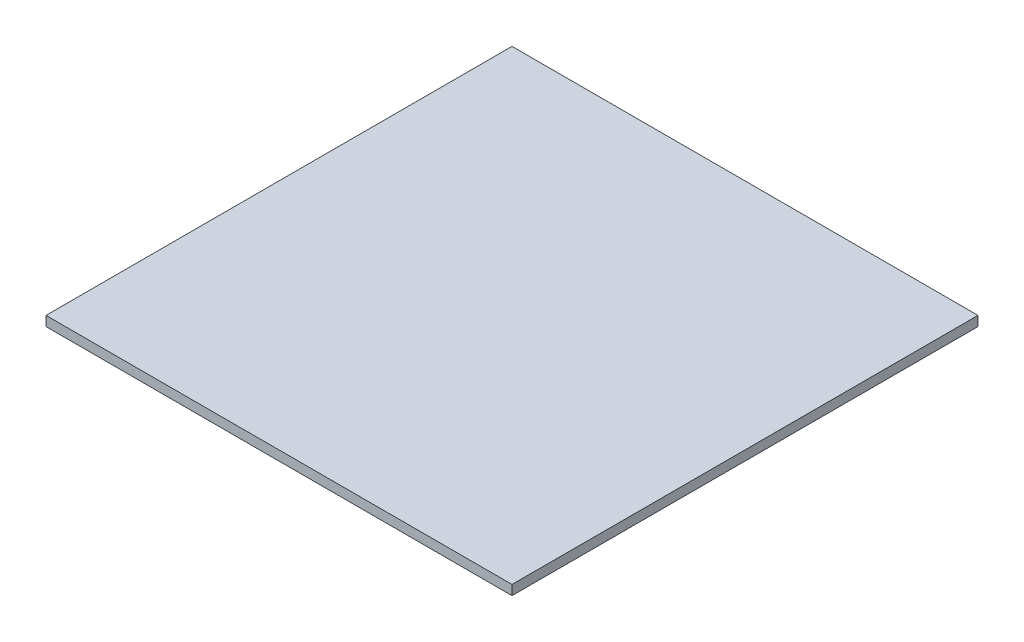
ISO-10303-21;
HEADER;
FILE_DESCRIPTION(('STEP AP214'),'2;1');
FILE_NAME('part.step','',(''),(''),'','','');
FILE_SCHEMA(('AUTOMOTIVE_DESIGN { 1 0 10303 214 1 1 1 1 }'));
ENDSEC;
DATA;
#1=APPLICATION_CONTEXT('core data for automotive mechanical design processes');
#2=APPLICATION_PROTOCOL_DEFINITION('international standard','automotive_design',2000,#1);
#3=PRODUCT_CONTEXT('',#1,'mechanical');
#4=PRODUCT('Part','Part','',(#3));
#5=PRODUCT_RELATED_PRODUCT_CATEGORY('part','',(#4));
#6=PRODUCT_DEFINITION_FORMATION('','',#4);
#7=PRODUCT_DEFINITION_CONTEXT('part definition',#1,'design');
#8=PRODUCT_DEFINITION('design','',#6,#7);
#9=PRODUCT_DEFINITION_SHAPE('','',#8);
#10=(LENGTH_UNIT() NAMED_UNIT(*) SI_UNIT(.MILLI.,.METRE.));
#11=(NAMED_UNIT(*) PLANE_ANGLE_UNIT() SI_UNIT($,.RADIAN.));
#12=(NAMED_UNIT(*) SI_UNIT($,.STERADIAN.) SOLID_ANGLE_UNIT());
#13=UNCERTAINTY_MEASURE_WITH_UNIT(LENGTH_MEASURE(1.E-05),#10,'distance_accuracy_value','');
#14=(GEOMETRIC_REPRESENTATION_CONTEXT(3) GLOBAL_UNCERTAINTY_ASSIGNED_CONTEXT((#13)) GLOBAL_UNIT_ASSIGNED_CONTEXT((#10,
#11,#12)) REPRESENTATION_CONTEXT('',''));
#15=CARTESIAN_POINT('',(0.,0.,0.));
#16=DIRECTION('',(0.,0.,1.));
#17=DIRECTION('',(1.,0.,0.));
#18=AXIS2_PLACEMENT_3D('',#15,#16,#17);
#19=CARTESIAN_POINT('',(96.2971918100541,185.74712943712,-148.529034586993));
#20=DIRECTION('',(0.,0.,1.));
#21=DIRECTION('',(1.,0.,0.));
#22=AXIS2_PLACEMENT_3D('',#19,#20,#21);
#23=PLANE('',#22);
#24=DIRECTION('',(-1.,0.,0.));
#25=VECTOR('',#24,1.);
#26=CARTESIAN_POINT('',(96.2971918100541,180.74712943712,-148.529034586993));
#27=LINE('',#26,#25);
#28=CARTESIAN_POINT('',(96.2971918100541,180.74712943712,-148.529034586993));
#29=VERTEX_POINT('',#28);
#30=CARTESIAN_POINT('',(-143.702808189946,180.74712943712,-148.529034586993));
#31=VERTEX_POINT('',#30);
#32=EDGE_CURVE('E99',#29,#31,#27,.T.);
#33=ORIENTED_EDGE('',*,*,#32,.T.);
#34=DIRECTION('',(0.,-1.,0.));
#35=VECTOR('',#34,1.);
#36=CARTESIAN_POINT('',(-143.702808189946,185.74712943712,-148.529034586993));
#37=LINE('',#36,#35);
#38=CARTESIAN_POINT('',(-143.702808189946,185.74712943712,-148.529034586993));
#39=VERTEX_POINT('',#38);
#40=EDGE_CURVE('E11',#39,#31,#37,.T.);
#41=ORIENTED_EDGE('',*,*,#40,.F.);
#42=DIRECTION('',(-1.,0.,0.));
#43=VECTOR('',#42,1.);
#44=CARTESIAN_POINT('',(96.2971918100541,185.74712943712,-148.529034586993));
#45=LINE('',#44,#43);
#46=CARTESIAN_POINT('',(96.2971918100541,185.74712943712,-148.529034586993));
#47=VERTEX_POINT('',#46);
#48=EDGE_CURVE('E87',#47,#39,#45,.T.);
#49=ORIENTED_EDGE('',*,*,#48,.F.);
#50=DIRECTION('',(0.,-1.,0.));
#51=VECTOR('',#50,1.);
#52=CARTESIAN_POINT('',(96.2971918100541,185.74712943712,-148.529034586993));
#53=LINE('',#52,#51);
#54=EDGE_CURVE('E95',#47,#29,#53,.T.);
#55=ORIENTED_EDGE('',*,*,#54,.T.);
#56=EDGE_LOOP('',(#33,#41,#49,#55));
#57=FACE_BOUND('',#56,.T.);
#58=ADVANCED_FACE('F36',(#57),#23,.F.);
#59=CARTESIAN_POINT('',(-143.702808189946,185.74712943712,-148.529034586993));
#60=DIRECTION('',(1.,0.,0.));
#61=DIRECTION('',(0.,0.,-1.));
#62=AXIS2_PLACEMENT_3D('',#59,#60,#61);
#63=PLANE('',#62);
#64=DIRECTION('',(0.,0.,1.));
#65=VECTOR('',#64,1.);
#66=CARTESIAN_POINT('',(-143.702808189946,180.74712943712,-148.529034586993));
#67=LINE('',#66,#65);
#68=CARTESIAN_POINT('',(-143.702808189946,180.74712943712,91.4709654130073));
#69=VERTEX_POINT('',#68);
#70=EDGE_CURVE('E91',#31,#69,#67,.T.);
#71=ORIENTED_EDGE('',*,*,#70,.T.);
#72=DIRECTION('',(0.,-1.,0.));
#73=VECTOR('',#72,1.);
#74=CARTESIAN_POINT('',(-143.702808189946,185.74712943712,91.4709654130073));
#75=LINE('',#74,#73);
#76=CARTESIAN_POINT('',(-143.702808189946,185.74712943712,91.4709654130073));
#77=VERTEX_POINT('',#76);
#78=EDGE_CURVE('E44',#77,#69,#75,.T.);
#79=ORIENTED_EDGE('',*,*,#78,.F.);
#80=DIRECTION('',(0.,0.,1.));
#81=VECTOR('',#80,1.);
#82=CARTESIAN_POINT('',(-143.702808189946,185.74712943712,-148.529034586993));
#83=LINE('',#82,#81);
#84=EDGE_CURVE('E82',#39,#77,#83,.T.);
#85=ORIENTED_EDGE('',*,*,#84,.F.);
#86=ORIENTED_EDGE('',*,*,#40,.T.);
#87=EDGE_LOOP('',(#71,#79,#85,#86));
#88=FACE_BOUND('',#87,.T.);
#89=ADVANCED_FACE('F90',(#88),#63,.F.);
#90=CARTESIAN_POINT('',(-143.702808189946,185.74712943712,91.4709654130073));
#91=DIRECTION('',(0.,0.,-1.));
#92=DIRECTION('',(-1.,0.,0.));
#93=AXIS2_PLACEMENT_3D('',#90,#91,#92);
#94=PLANE('',#93);
#95=DIRECTION('',(1.,0.,0.));
#96=VECTOR('',#95,1.);
#97=CARTESIAN_POINT('',(-143.702808189946,180.74712943712,91.4709654130073));
#98=LINE('',#97,#96);
#99=CARTESIAN_POINT('',(96.2971918100541,180.74712943712,91.4709654130073));
#100=VERTEX_POINT('',#99);
#101=EDGE_CURVE('E69',#69,#100,#98,.T.);
#102=ORIENTED_EDGE('',*,*,#101,.T.);
#103=DIRECTION('',(0.,-1.,0.));
#104=VECTOR('',#103,1.);
#105=CARTESIAN_POINT('',(96.2971918100541,185.74712943712,91.4709654130073));
#106=LINE('',#105,#104);
#107=CARTESIAN_POINT('',(96.2971918100541,185.74712943712,91.4709654130073));
#108=VERTEX_POINT('',#107);
#109=EDGE_CURVE('E92',#108,#100,#106,.T.);
#110=ORIENTED_EDGE('',*,*,#109,.F.);
#111=DIRECTION('',(1.,0.,0.));
#112=VECTOR('',#111,1.);
#113=CARTESIAN_POINT('',(-143.702808189946,185.74712943712,91.4709654130073));
#114=LINE('',#113,#112);
#115=EDGE_CURVE('E85',#77,#108,#114,.T.);
#116=ORIENTED_EDGE('',*,*,#115,.F.);
#117=ORIENTED_EDGE('',*,*,#78,.T.);
#118=EDGE_LOOP('',(#102,#110,#116,#117));
#119=FACE_BOUND('',#118,.T.);
#120=ADVANCED_FACE('F93',(#119),#94,.F.);
#121=CARTESIAN_POINT('',(96.2971918100541,185.74712943712,91.4709654130073));
#122=DIRECTION('',(-1.,0.,0.));
#123=DIRECTION('',(0.,0.,1.));
#124=AXIS2_PLACEMENT_3D('',#121,#122,#123);
#125=PLANE('',#124);
#126=DIRECTION('',(0.,0.,-1.));
#127=VECTOR('',#126,1.);
#128=CARTESIAN_POINT('',(96.2971918100541,180.74712943712,91.4709654130073));
#129=LINE('',#128,#127);
#130=EDGE_CURVE('E75',#100,#29,#129,.T.);
#131=ORIENTED_EDGE('',*,*,#130,.T.);
#132=ORIENTED_EDGE('',*,*,#54,.F.);
#133=DIRECTION('',(0.,0.,-1.));
#134=VECTOR('',#133,1.);
#135=CARTESIAN_POINT('',(96.2971918100541,185.74712943712,91.4709654130073));
#136=LINE('',#135,#134);
#137=EDGE_CURVE('E52',#108,#47,#136,.T.);
#138=ORIENTED_EDGE('',*,*,#137,.F.);
#139=ORIENTED_EDGE('',*,*,#109,.T.);
#140=EDGE_LOOP('',(#131,#132,#138,#139));
#141=FACE_BOUND('',#140,.T.);
#142=ADVANCED_FACE('F107',(#141),#125,.F.);
#143=CARTESIAN_POINT('',(0.,185.74712943712,0.));
#144=DIRECTION('',(0.,1.,0.));
#145=DIRECTION('',(0.,0.,1.));
#146=AXIS2_PLACEMENT_3D('',#143,#144,#145);
#147=PLANE('',#146);
#148=ORIENTED_EDGE('',*,*,#48,.T.);
#149=ORIENTED_EDGE('',*,*,#84,.T.);
#150=ORIENTED_EDGE('',*,*,#115,.T.);
#151=ORIENTED_EDGE('',*,*,#137,.T.);
#152=EDGE_LOOP('',(#148,#149,#150,#151));
#153=FACE_BOUND('',#152,.T.);
#154=ADVANCED_FACE('F83',(#153),#147,.T.);
#155=CARTESIAN_POINT('',(0.,180.74712943712,0.));
#156=DIRECTION('',(0.,1.,0.));
#157=DIRECTION('',(0.,0.,1.));
#158=AXIS2_PLACEMENT_3D('',#155,#156,#157);
#159=PLANE('',#158);
#160=CARTESIAN_POINT('',(-138.702808189946,180.74712943712,-143.529034586993));
#161=DIRECTION('',(0.,-1.,0.));
#162=DIRECTION('',(0.,0.,-1.));
#163=AXIS2_PLACEMENT_3D('',#160,#161,#162);
#164=CIRCLE('',#163,3.00000000000002);
#165=CARTESIAN_POINT('',(-138.702808189946,180.74712943712,-146.529034586993));
#166=VERTEX_POINT('',#165);
#167=EDGE_CURVE('E122',#166,#166,#164,.T.);
#168=ORIENTED_EDGE('',*,*,#167,.F.);
#169=EDGE_LOOP('',(#168));
#170=FACE_BOUND('',#169,.T.);
#171=CARTESIAN_POINT('',(91.2971918100541,180.74712943712,-143.529034586993));
#172=DIRECTION('',(0.,-1.,0.));
#173=DIRECTION('',(0.,0.,-1.));
#174=AXIS2_PLACEMENT_3D('',#171,#172,#173);
#175=CIRCLE('',#174,3.00000000000001);
#176=CARTESIAN_POINT('',(91.2971918100541,180.74712943712,-146.529034586993));
#177=VERTEX_POINT('',#176);
#178=EDGE_CURVE('E128',#177,#177,#175,.T.);
#179=ORIENTED_EDGE('',*,*,#178,.F.);
#180=EDGE_LOOP('',(#179));
#181=FACE_BOUND('',#180,.T.);
#182=CARTESIAN_POINT('',(91.2971918100541,180.74712943712,86.4709654130073));
#183=DIRECTION('',(0.,-1.,0.));
#184=DIRECTION('',(0.,0.,-1.));
#185=AXIS2_PLACEMENT_3D('',#182,#183,#184);
#186=CIRCLE('',#185,2.99999999999999);
#187=CARTESIAN_POINT('',(91.2971918100541,180.74712943712,83.4709654130073));
#188=VERTEX_POINT('',#187);
#189=EDGE_CURVE('E116',#188,#188,#186,.T.);
#190=ORIENTED_EDGE('',*,*,#189,.F.);
#191=EDGE_LOOP('',(#190));
#192=FACE_BOUND('',#191,.T.);
#193=CARTESIAN_POINT('',(-138.702808189946,180.74712943712,86.4709654130073));
#194=DIRECTION('',(0.,-1.,0.));
#195=DIRECTION('',(0.,0.,-1.));
#196=AXIS2_PLACEMENT_3D('',#193,#194,#195);
#197=CIRCLE('',#196,2.99999999999999);
#198=CARTESIAN_POINT('',(-138.702808189946,180.74712943712,83.4709654130073));
#199=VERTEX_POINT('',#198);
#200=EDGE_CURVE('E113',#199,#199,#197,.T.);
#201=ORIENTED_EDGE('',*,*,#200,.F.);
#202=EDGE_LOOP('',(#201));
#203=FACE_BOUND('',#202,.T.);
#204=ORIENTED_EDGE('',*,*,#32,.F.);
#205=ORIENTED_EDGE('',*,*,#130,.F.);
#206=ORIENTED_EDGE('',*,*,#101,.F.);
#207=ORIENTED_EDGE('',*,*,#70,.F.);
#208=EDGE_LOOP('',(#204,#205,#206,#207));
#209=FACE_BOUND('',#208,.T.);
#210=ADVANCED_FACE('F110',(#170,#181,#192,#203,#209),#159,.F.);
#211=CARTESIAN_POINT('',(-138.702808189946,182.74712943712,86.4709654130073));
#212=DIRECTION('',(0.,-1.,0.));
#213=DIRECTION('',(0.,0.,-1.));
#214=AXIS2_PLACEMENT_3D('',#211,#212,#213);
#215=CYLINDRICAL_SURFACE('',#214,2.99999999999999);
#216=CARTESIAN_POINT('',(-138.702808189946,182.74712943712,86.4709654130073));
#217=DIRECTION('',(0.,-1.,0.));
#218=DIRECTION('',(0.,0.,-1.));
#219=AXIS2_PLACEMENT_3D('',#216,#217,#218);
#220=CIRCLE('',#219,2.99999999999999);
#221=CARTESIAN_POINT('',(-138.702808189946,182.74712943712,83.4709654130073));
#222=VERTEX_POINT('',#221);
#223=EDGE_CURVE('E102',#222,#222,#220,.T.);
#224=ORIENTED_EDGE('',*,*,#223,.F.);
#225=EDGE_LOOP('',(#224));
#226=FACE_BOUND('',#225,.T.);
#227=ORIENTED_EDGE('',*,*,#200,.T.);
#228=EDGE_LOOP('',(#227));
#229=FACE_BOUND('',#228,.T.);
#230=ADVANCED_FACE('F141',(#226,#229),#215,.F.);
#231=CARTESIAN_POINT('',(-138.702808189946,182.74712943712,86.4709654130073));
#232=DIRECTION('',(0.,-1.,0.));
#233=DIRECTION('',(0.,0.,-1.));
#234=AXIS2_PLACEMENT_3D('',#231,#232,#233);
#235=PLANE('',#234);
#236=ORIENTED_EDGE('',*,*,#223,.T.);
#237=EDGE_LOOP('',(#236));
#238=FACE_BOUND('',#237,.T.);
#239=ADVANCED_FACE('F147',(#238),#235,.T.);
#240=CARTESIAN_POINT('',(91.2971918100541,182.74712943712,86.4709654130073));
#241=DIRECTION('',(0.,-1.,0.));
#242=DIRECTION('',(0.,0.,-1.));
#243=AXIS2_PLACEMENT_3D('',#240,#241,#242);
#244=CYLINDRICAL_SURFACE('',#243,2.99999999999999);
#245=CARTESIAN_POINT('',(91.2971918100541,182.74712943712,86.4709654130073));
#246=DIRECTION('',(0.,-1.,0.));
#247=DIRECTION('',(0.,0.,-1.));
#248=AXIS2_PLACEMENT_3D('',#245,#246,#247);
#249=CIRCLE('',#248,2.99999999999999);
#250=CARTESIAN_POINT('',(91.2971918100541,182.74712943712,83.4709654130073));
#251=VERTEX_POINT('',#250);
#252=EDGE_CURVE('E131',#251,#251,#249,.T.);
#253=ORIENTED_EDGE('',*,*,#252,.F.);
#254=EDGE_LOOP('',(#253));
#255=FACE_BOUND('',#254,.T.);
#256=ORIENTED_EDGE('',*,*,#189,.T.);
#257=EDGE_LOOP('',(#256));
#258=FACE_BOUND('',#257,.T.);
#259=ADVANCED_FACE('F137',(#255,#258),#244,.F.);
#260=CARTESIAN_POINT('',(91.2971918100541,182.74712943712,86.4709654130073));
#261=DIRECTION('',(0.,-1.,0.));
#262=DIRECTION('',(0.,0.,-1.));
#263=AXIS2_PLACEMENT_3D('',#260,#261,#262);
#264=PLANE('',#263);
#265=ORIENTED_EDGE('',*,*,#252,.T.);
#266=EDGE_LOOP('',(#265));
#267=FACE_BOUND('',#266,.T.);
#268=ADVANCED_FACE('F198',(#267),#264,.T.);
#269=CARTESIAN_POINT('',(91.2971918100541,182.74712943712,-143.529034586993));
#270=DIRECTION('',(0.,-1.,0.));
#271=DIRECTION('',(0.,0.,-1.));
#272=AXIS2_PLACEMENT_3D('',#269,#270,#271);
#273=CYLINDRICAL_SURFACE('',#272,3.00000000000001);
#274=CARTESIAN_POINT('',(91.2971918100541,182.74712943712,-143.529034586993));
#275=DIRECTION('',(0.,-1.,0.));
#276=DIRECTION('',(0.,0.,-1.));
#277=AXIS2_PLACEMENT_3D('',#274,#275,#276);
#278=CIRCLE('',#277,3.00000000000001);
#279=CARTESIAN_POINT('',(91.2971918100541,182.74712943712,-146.529034586993));
#280=VERTEX_POINT('',#279);
#281=EDGE_CURVE('E125',#280,#280,#278,.T.);
#282=ORIENTED_EDGE('',*,*,#281,.F.);
#283=EDGE_LOOP('',(#282));
#284=FACE_BOUND('',#283,.T.);
#285=ORIENTED_EDGE('',*,*,#178,.T.);
#286=EDGE_LOOP('',(#285));
#287=FACE_BOUND('',#286,.T.);
#288=ADVANCED_FACE('F209',(#284,#287),#273,.F.);
#289=CARTESIAN_POINT('',(91.2971918100541,182.74712943712,-143.529034586993));
#290=DIRECTION('',(0.,-1.,0.));
#291=DIRECTION('',(0.,0.,-1.));
#292=AXIS2_PLACEMENT_3D('',#289,#290,#291);
#293=PLANE('',#292);
#294=ORIENTED_EDGE('',*,*,#281,.T.);
#295=EDGE_LOOP('',(#294));
#296=FACE_BOUND('',#295,.T.);
#297=ADVANCED_FACE('F220',(#296),#293,.T.);
#298=CARTESIAN_POINT('',(-138.702808189946,182.74712943712,-143.529034586993));
#299=DIRECTION('',(0.,-1.,0.));
#300=DIRECTION('',(0.,0.,-1.));
#301=AXIS2_PLACEMENT_3D('',#298,#299,#300);
#302=CYLINDRICAL_SURFACE('',#301,3.00000000000002);
#303=CARTESIAN_POINT('',(-138.702808189946,182.74712943712,-143.529034586993));
#304=DIRECTION('',(0.,-1.,0.));
#305=DIRECTION('',(0.,0.,-1.));
#306=AXIS2_PLACEMENT_3D('',#303,#304,#305);
#307=CIRCLE('',#306,3.00000000000002);
#308=CARTESIAN_POINT('',(-138.702808189946,182.74712943712,-146.529034586993));
#309=VERTEX_POINT('',#308);
#310=EDGE_CURVE('E119',#309,#309,#307,.T.);
#311=ORIENTED_EDGE('',*,*,#310,.F.);
#312=EDGE_LOOP('',(#311));
#313=FACE_BOUND('',#312,.T.);
#314=ORIENTED_EDGE('',*,*,#167,.T.);
#315=EDGE_LOOP('',(#314));
#316=FACE_BOUND('',#315,.T.);
#317=ADVANCED_FACE('F231',(#313,#316),#302,.F.);
#318=CARTESIAN_POINT('',(-138.702808189946,182.74712943712,-143.529034586993));
#319=DIRECTION('',(0.,-1.,0.));
#320=DIRECTION('',(0.,0.,-1.));
#321=AXIS2_PLACEMENT_3D('',#318,#319,#320);
#322=PLANE('',#321);
#323=ORIENTED_EDGE('',*,*,#310,.T.);
#324=EDGE_LOOP('',(#323));
#325=FACE_BOUND('',#324,.T.);
#326=ADVANCED_FACE('F242',(#325),#322,.T.);
#327=CLOSED_SHELL('',(#58,#89,#120,#142,#154,#210,#230,#239,#259,#268,#288,#297,#317,#326));
#328=MANIFOLD_SOLID_BREP('B2',#327);
#329=ADVANCED_BREP_SHAPE_REPRESENTATION('',(#18,#328),#14);
#330=SHAPE_DEFINITION_REPRESENTATION(#9,#329);
ENDSEC;
END-ISO-10303-21;
